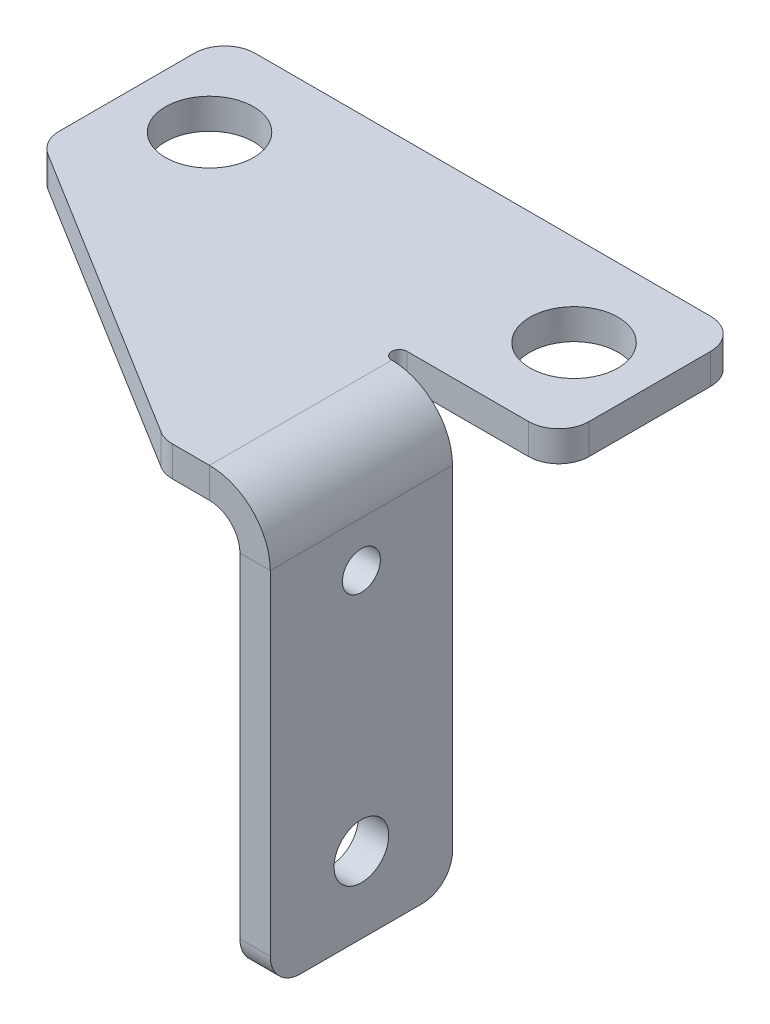
ISO-10303-21;
HEADER;
FILE_DESCRIPTION(('STEP AP214'),'2;1');
FILE_NAME('part.step','',(''),(''),'','','');
FILE_SCHEMA(('AUTOMOTIVE_DESIGN { 1 0 10303 214 1 1 1 1 }'));
ENDSEC;
DATA;
#1=APPLICATION_CONTEXT('core data for automotive mechanical design processes');
#2=APPLICATION_PROTOCOL_DEFINITION('international standard','automotive_design',2000,#1);
#3=PRODUCT_CONTEXT('',#1,'mechanical');
#4=PRODUCT('Part','Part','',(#3));
#5=PRODUCT_RELATED_PRODUCT_CATEGORY('part','',(#4));
#6=PRODUCT_DEFINITION_FORMATION('','',#4);
#7=PRODUCT_DEFINITION_CONTEXT('part definition',#1,'design');
#8=PRODUCT_DEFINITION('design','',#6,#7);
#9=PRODUCT_DEFINITION_SHAPE('','',#8);
#10=(LENGTH_UNIT() NAMED_UNIT(*) SI_UNIT(.MILLI.,.METRE.));
#11=(NAMED_UNIT(*) PLANE_ANGLE_UNIT() SI_UNIT($,.RADIAN.));
#12=(NAMED_UNIT(*) SI_UNIT($,.STERADIAN.) SOLID_ANGLE_UNIT());
#13=UNCERTAINTY_MEASURE_WITH_UNIT(LENGTH_MEASURE(1.E-05),#10,'distance_accuracy_value','');
#14=(GEOMETRIC_REPRESENTATION_CONTEXT(3) GLOBAL_UNCERTAINTY_ASSIGNED_CONTEXT((#13)) GLOBAL_UNIT_ASSIGNED_CONTEXT((#10,
#11,#12)) REPRESENTATION_CONTEXT('',''));
#15=CARTESIAN_POINT('',(0.,0.,0.));
#16=DIRECTION('',(0.,0.,1.));
#17=DIRECTION('',(1.,0.,0.));
#18=AXIS2_PLACEMENT_3D('',#15,#16,#17);
#19=CARTESIAN_POINT('',(-10.,2.,0.));
#20=DIRECTION('',(0.,0.,-1.));
#21=DIRECTION('',(-1.,0.,0.));
#22=AXIS2_PLACEMENT_3D('',#19,#20,#21);
#23=PLANE('',#22);
#24=DIRECTION('',(1.,0.,0.));
#25=VECTOR('',#24,1.);
#26=CARTESIAN_POINT('',(-10.,0.,0.));
#27=LINE('',#26,#25);
#28=CARTESIAN_POINT('',(-10.,0.,0.));
#29=VERTEX_POINT('',#28);
#30=CARTESIAN_POINT('',(-2.,0.,0.));
#31=VERTEX_POINT('',#30);
#32=EDGE_CURVE('E254',#29,#31,#27,.T.);
#33=ORIENTED_EDGE('',*,*,#32,.T.);
#34=DIRECTION('',(0.,-1.,0.));
#35=VECTOR('',#34,1.);
#36=CARTESIAN_POINT('',(-2.,2.,0.));
#37=LINE('',#36,#35);
#38=CARTESIAN_POINT('',(-2.,2.,0.));
#39=VERTEX_POINT('',#38);
#40=EDGE_CURVE('E13',#31,#39,#37,.F.);
#41=ORIENTED_EDGE('',*,*,#40,.T.);
#42=DIRECTION('',(1.,0.,0.));
#43=VECTOR('',#42,1.);
#44=CARTESIAN_POINT('',(-10.,2.,0.));
#45=LINE('',#44,#43);
#46=CARTESIAN_POINT('',(-10.,2.,0.));
#47=VERTEX_POINT('',#46);
#48=EDGE_CURVE('E259',#47,#39,#45,.T.);
#49=ORIENTED_EDGE('',*,*,#48,.F.);
#50=DIRECTION('',(0.,-1.,0.));
#51=VECTOR('',#50,1.);
#52=CARTESIAN_POINT('',(-10.,2.,0.));
#53=LINE('',#52,#51);
#54=EDGE_CURVE('E278',#47,#29,#53,.T.);
#55=ORIENTED_EDGE('',*,*,#54,.T.);
#56=EDGE_LOOP('',(#33,#41,#49,#55));
#57=FACE_BOUND('',#56,.T.);
#58=ADVANCED_FACE('F66',(#57),#23,.F.);
#59=CARTESIAN_POINT('',(0.,2.,0.));
#60=DIRECTION('',(-1.,0.,0.));
#61=DIRECTION('',(0.,0.,1.));
#62=AXIS2_PLACEMENT_3D('',#59,#60,#61);
#63=PLANE('',#62);
#64=DIRECTION('',(0.,0.,-1.));
#65=VECTOR('',#64,1.);
#66=CARTESIAN_POINT('',(0.,0.,0.));
#67=LINE('',#66,#65);
#68=CARTESIAN_POINT('',(0.,0.,-2.));
#69=VERTEX_POINT('',#68);
#70=CARTESIAN_POINT('',(0.,0.,-10.));
#71=VERTEX_POINT('',#70);
#72=EDGE_CURVE('E281',#69,#71,#67,.T.);
#73=ORIENTED_EDGE('',*,*,#72,.T.);
#74=DIRECTION('',(0.,-1.,0.));
#75=VECTOR('',#74,1.);
#76=CARTESIAN_POINT('',(0.,2.,-10.));
#77=LINE('',#76,#75);
#78=CARTESIAN_POINT('',(0.,2.,-10.));
#79=VERTEX_POINT('',#78);
#80=EDGE_CURVE('E74',#71,#79,#77,.F.);
#81=ORIENTED_EDGE('',*,*,#80,.T.);
#82=DIRECTION('',(0.,0.,-1.));
#83=VECTOR('',#82,1.);
#84=CARTESIAN_POINT('',(0.,2.,0.));
#85=LINE('',#84,#83);
#86=CARTESIAN_POINT('',(0.,2.,-2.));
#87=VERTEX_POINT('',#86);
#88=EDGE_CURVE('E262',#87,#79,#85,.T.);
#89=ORIENTED_EDGE('',*,*,#88,.F.);
#90=DIRECTION('',(0.,-1.,0.));
#91=VECTOR('',#90,1.);
#92=CARTESIAN_POINT('',(0.,2.,-2.));
#93=LINE('',#92,#91);
#94=EDGE_CURVE('E365',#87,#69,#93,.T.);
#95=ORIENTED_EDGE('',*,*,#94,.T.);
#96=EDGE_LOOP('',(#73,#81,#89,#95));
#97=FACE_BOUND('',#96,.T.);
#98=ADVANCED_FACE('F370',(#97),#63,.F.);
#99=CARTESIAN_POINT('',(0.,2.,-12.));
#100=DIRECTION('',(0.,0.,1.));
#101=DIRECTION('',(1.,0.,0.));
#102=AXIS2_PLACEMENT_3D('',#99,#100,#101);
#103=PLANE('',#102);
#104=DIRECTION('',(-1.,0.,0.));
#105=VECTOR('',#104,1.);
#106=CARTESIAN_POINT('',(0.,0.,-12.));
#107=LINE('',#106,#105);
#108=CARTESIAN_POINT('',(-2.,0.,-12.));
#109=VERTEX_POINT('',#108);
#110=CARTESIAN_POINT('',(-32.,0.,-12.));
#111=VERTEX_POINT('',#110);
#112=EDGE_CURVE('E284',#109,#111,#107,.T.);
#113=ORIENTED_EDGE('',*,*,#112,.T.);
#114=DIRECTION('',(0.,-1.,0.));
#115=VECTOR('',#114,1.);
#116=CARTESIAN_POINT('',(-32.,2.,-12.));
#117=LINE('',#116,#115);
#118=CARTESIAN_POINT('',(-32.,2.,-12.));
#119=VERTEX_POINT('',#118);
#120=EDGE_CURVE('E363',#111,#119,#117,.F.);
#121=ORIENTED_EDGE('',*,*,#120,.T.);
#122=DIRECTION('',(-1.,0.,0.));
#123=VECTOR('',#122,1.);
#124=CARTESIAN_POINT('',(0.,2.,-12.));
#125=LINE('',#124,#123);
#126=CARTESIAN_POINT('',(-2.,2.,-12.));
#127=VERTEX_POINT('',#126);
#128=EDGE_CURVE('E266',#127,#119,#125,.T.);
#129=ORIENTED_EDGE('',*,*,#128,.F.);
#130=DIRECTION('',(0.,-1.,0.));
#131=VECTOR('',#130,1.);
#132=CARTESIAN_POINT('',(-2.,2.,-12.));
#133=LINE('',#132,#131);
#134=EDGE_CURVE('E360',#127,#109,#133,.T.);
#135=ORIENTED_EDGE('',*,*,#134,.T.);
#136=EDGE_LOOP('',(#113,#121,#129,#135));
#137=FACE_BOUND('',#136,.T.);
#138=ADVANCED_FACE('F382',(#137),#103,.F.);
#139=CARTESIAN_POINT('',(-34.,2.,-12.));
#140=DIRECTION('',(1.,0.,0.));
#141=DIRECTION('',(0.,0.,-1.));
#142=AXIS2_PLACEMENT_3D('',#139,#140,#141);
#143=PLANE('',#142);
#144=DIRECTION('',(0.,0.,1.));
#145=VECTOR('',#144,1.);
#146=CARTESIAN_POINT('',(-34.,0.,-12.));
#147=LINE('',#146,#145);
#148=CARTESIAN_POINT('',(-34.,0.,-10.));
#149=VERTEX_POINT('',#148);
#150=CARTESIAN_POINT('',(-34.,0.,-1.11411219718637));
#151=VERTEX_POINT('',#150);
#152=EDGE_CURVE('E287',#149,#151,#147,.T.);
#153=ORIENTED_EDGE('',*,*,#152,.T.);
#154=DIRECTION('',(0.,-1.,0.));
#155=VECTOR('',#154,1.);
#156=CARTESIAN_POINT('',(-34.,2.,-1.11411219718637));
#157=LINE('',#156,#155);
#158=CARTESIAN_POINT('',(-34.,2.,-1.11411219718637));
#159=VERTEX_POINT('',#158);
#160=EDGE_CURVE('E81',#151,#159,#157,.F.);
#161=ORIENTED_EDGE('',*,*,#160,.T.);
#162=DIRECTION('',(0.,0.,1.));
#163=VECTOR('',#162,1.);
#164=CARTESIAN_POINT('',(-34.,2.,-12.));
#165=LINE('',#164,#163);
#166=CARTESIAN_POINT('',(-34.,2.,-10.));
#167=VERTEX_POINT('',#166);
#168=EDGE_CURVE('E268',#167,#159,#165,.T.);
#169=ORIENTED_EDGE('',*,*,#168,.F.);
#170=DIRECTION('',(0.,-1.,0.));
#171=VECTOR('',#170,1.);
#172=CARTESIAN_POINT('',(-34.,2.,-10.));
#173=LINE('',#172,#171);
#174=EDGE_CURVE('E356',#167,#149,#173,.T.);
#175=ORIENTED_EDGE('',*,*,#174,.T.);
#176=EDGE_LOOP('',(#153,#161,#169,#175));
#177=FACE_BOUND('',#176,.T.);
#178=ADVANCED_FACE('F391',(#177),#143,.F.);
#179=CARTESIAN_POINT('',(-34.,2.,0.));
#180=DIRECTION('',(0.526354614616296,0.,-0.850265146687862));
#181=DIRECTION('',(-0.850265146687862,0.,-0.526354614616296));
#182=AXIS2_PLACEMENT_3D('',#179,#180,#181);
#183=PLANE('',#182);
#184=DIRECTION('',(0.850265146687862,0.,0.526354614616296));
#185=VECTOR('',#184,1.);
#186=CARTESIAN_POINT('',(-34.,0.,0.));
#187=LINE('',#186,#185);
#188=CARTESIAN_POINT('',(-33.0527092292326,0.,0.58641809618935));
#189=VERTEX_POINT('',#188);
#190=CARTESIAN_POINT('',(-13.4837587568546,0.,12.7005302933757));
#191=VERTEX_POINT('',#190);
#192=EDGE_CURVE('E289',#189,#191,#187,.T.);
#193=ORIENTED_EDGE('',*,*,#192,.T.);
#194=DIRECTION('',(0.,-1.,0.));
#195=VECTOR('',#194,1.);
#196=CARTESIAN_POINT('',(-13.4837587568546,2.,12.7005302933757));
#197=LINE('',#196,#195);
#198=CARTESIAN_POINT('',(-13.4837587568546,2.,12.7005302933757));
#199=VERTEX_POINT('',#198);
#200=EDGE_CURVE('E345',#191,#199,#197,.F.);
#201=ORIENTED_EDGE('',*,*,#200,.T.);
#202=DIRECTION('',(0.850265146687862,0.,0.526354614616296));
#203=VECTOR('',#202,1.);
#204=CARTESIAN_POINT('',(-34.,2.,0.));
#205=LINE('',#204,#203);
#206=CARTESIAN_POINT('',(-33.0527092292326,2.,0.58641809618935));
#207=VERTEX_POINT('',#206);
#208=EDGE_CURVE('E270',#207,#199,#205,.T.);
#209=ORIENTED_EDGE('',*,*,#208,.F.);
#210=DIRECTION('',(0.,-1.,0.));
#211=VECTOR('',#210,1.);
#212=CARTESIAN_POINT('',(-33.0527092292326,2.,0.58641809618935));
#213=LINE('',#212,#211);
#214=EDGE_CURVE('E342',#207,#189,#213,.T.);
#215=ORIENTED_EDGE('',*,*,#214,.T.);
#216=EDGE_LOOP('',(#193,#201,#209,#215));
#217=FACE_BOUND('',#216,.T.);
#218=ADVANCED_FACE('F399',(#217),#183,.F.);
#219=CARTESIAN_POINT('',(-10.,2.,13.));
#220=DIRECTION('',(0.,0.,-1.));
#221=DIRECTION('',(-1.,0.,0.));
#222=AXIS2_PLACEMENT_3D('',#219,#220,#221);
#223=PLANE('',#222);
#224=DIRECTION('',(1.,0.,0.));
#225=VECTOR('',#224,1.);
#226=CARTESIAN_POINT('',(-10.,2.,13.));
#227=LINE('',#226,#225);
#228=CARTESIAN_POINT('',(-12.431049527622,2.,13.));
#229=VERTEX_POINT('',#228);
#230=CARTESIAN_POINT('',(-10.,2.,13.));
#231=VERTEX_POINT('',#230);
#232=EDGE_CURVE('E273',#229,#231,#227,.T.);
#233=ORIENTED_EDGE('',*,*,#232,.F.);
#234=DIRECTION('',(0.,-1.,0.));
#235=VECTOR('',#234,1.);
#236=CARTESIAN_POINT('',(-12.431049527622,2.,13.));
#237=LINE('',#236,#235);
#238=CARTESIAN_POINT('',(-12.431049527622,0.,13.));
#239=VERTEX_POINT('',#238);
#240=EDGE_CURVE('E329',#229,#239,#237,.T.);
#241=ORIENTED_EDGE('',*,*,#240,.T.);
#242=DIRECTION('',(1.,0.,0.));
#243=VECTOR('',#242,1.);
#244=CARTESIAN_POINT('',(-10.,0.,13.));
#245=LINE('',#244,#243);
#246=CARTESIAN_POINT('',(-10.,0.,13.));
#247=VERTEX_POINT('',#246);
#248=EDGE_CURVE('E292',#239,#247,#245,.T.);
#249=ORIENTED_EDGE('',*,*,#248,.T.);
#250=DIRECTION('',(0.,-1.,0.));
#251=VECTOR('',#250,1.);
#252=CARTESIAN_POINT('',(-10.,2.,13.));
#253=LINE('',#252,#251);
#254=EDGE_CURVE('E302',#231,#247,#253,.T.);
#255=ORIENTED_EDGE('',*,*,#254,.F.);
#256=EDGE_LOOP('',(#233,#241,#249,#255));
#257=FACE_BOUND('',#256,.T.);
#258=ADVANCED_FACE('F408',(#257),#223,.F.);
#259=CARTESIAN_POINT('',(-10.,2.,0.5));
#260=DIRECTION('',(0.,-1.,0.));
#261=DIRECTION('',(0.,0.,-1.));
#262=AXIS2_PLACEMENT_3D('',#259,#260,#261);
#263=CYLINDRICAL_SURFACE('',#262,0.5);
#264=CARTESIAN_POINT('',(-10.,0.,0.5));
#265=DIRECTION('',(0.,-1.,0.));
#266=DIRECTION('',(0.,0.,-1.));
#267=AXIS2_PLACEMENT_3D('',#264,#265,#266);
#268=CIRCLE('',#267,0.5);
#269=CARTESIAN_POINT('',(-10.,0.,1.));
#270=VERTEX_POINT('',#269);
#271=EDGE_CURVE('E263',#270,#29,#268,.T.);
#272=ORIENTED_EDGE('',*,*,#271,.T.);
#273=ORIENTED_EDGE('',*,*,#54,.F.);
#274=CARTESIAN_POINT('',(-10.,2.,0.5));
#275=DIRECTION('',(0.,-1.,0.));
#276=DIRECTION('',(0.,0.,-1.));
#277=AXIS2_PLACEMENT_3D('',#274,#275,#276);
#278=CIRCLE('',#277,0.5);
#279=CARTESIAN_POINT('',(-10.,2.,1.));
#280=VERTEX_POINT('',#279);
#281=EDGE_CURVE('E276',#280,#47,#278,.T.);
#282=ORIENTED_EDGE('',*,*,#281,.F.);
#283=DIRECTION('',(0.,-1.,0.));
#284=VECTOR('',#283,1.);
#285=CARTESIAN_POINT('',(-10.,2.,1.));
#286=LINE('',#285,#284);
#287=EDGE_CURVE('E299',#280,#270,#286,.T.);
#288=ORIENTED_EDGE('',*,*,#287,.T.);
#289=EDGE_LOOP('',(#272,#273,#282,#288));
#290=FACE_BOUND('',#289,.T.);
#291=ADVANCED_FACE('F412',(#290),#263,.F.);
#292=CARTESIAN_POINT('',(-10.,2.,0.5));
#293=DIRECTION('',(0.,-1.,0.));
#294=DIRECTION('',(0.,0.,-1.));
#295=AXIS2_PLACEMENT_3D('',#292,#293,#294);
#296=PLANE('',#295);
#297=CARTESIAN_POINT('',(-29.,2.,-6.));
#298=DIRECTION('',(0.,1.,0.));
#299=DIRECTION('',(0.,0.,1.));
#300=AXIS2_PLACEMENT_3D('',#297,#298,#299);
#301=CIRCLE('',#300,2.9);
#302=CARTESIAN_POINT('',(-29.,2.,-3.1));
#303=VERTEX_POINT('',#302);
#304=EDGE_CURVE('E519',#303,#303,#301,.T.);
#305=ORIENTED_EDGE('',*,*,#304,.F.);
#306=EDGE_LOOP('',(#305));
#307=FACE_BOUND('',#306,.T.);
#308=CARTESIAN_POINT('',(-5.,2.,-6.));
#309=DIRECTION('',(0.,1.,0.));
#310=DIRECTION('',(0.,0.,1.));
#311=AXIS2_PLACEMENT_3D('',#308,#309,#310);
#312=CIRCLE('',#311,2.9);
#313=CARTESIAN_POINT('',(-5.,2.,-3.1));
#314=VERTEX_POINT('',#313);
#315=EDGE_CURVE('E307',#314,#314,#312,.T.);
#316=ORIENTED_EDGE('',*,*,#315,.F.);
#317=EDGE_LOOP('',(#316));
#318=FACE_BOUND('',#317,.T.);
#319=ORIENTED_EDGE('',*,*,#208,.T.);
#320=CARTESIAN_POINT('',(-12.431049527622,2.,11.));
#321=DIRECTION('',(0.,-1.,0.));
#322=DIRECTION('',(0.,0.,-1.));
#323=AXIS2_PLACEMENT_3D('',#320,#321,#322);
#324=CIRCLE('',#323,2.);
#325=EDGE_CURVE('E354',#199,#229,#324,.F.);
#326=ORIENTED_EDGE('',*,*,#325,.T.);
#327=ORIENTED_EDGE('',*,*,#232,.T.);
#328=DIRECTION('',(0.,0.,-1.));
#329=VECTOR('',#328,1.);
#330=CARTESIAN_POINT('',(-10.,2.,13.));
#331=LINE('',#330,#329);
#332=EDGE_CURVE('E206',#231,#280,#331,.T.);
#333=ORIENTED_EDGE('',*,*,#332,.T.);
#334=ORIENTED_EDGE('',*,*,#281,.T.);
#335=ORIENTED_EDGE('',*,*,#48,.T.);
#336=CARTESIAN_POINT('',(-2.,2.,-2.));
#337=DIRECTION('',(0.,-1.,0.));
#338=DIRECTION('',(0.,0.,-1.));
#339=AXIS2_PLACEMENT_3D('',#336,#337,#338);
#340=CIRCLE('',#339,2.);
#341=EDGE_CURVE('E347',#39,#87,#340,.F.);
#342=ORIENTED_EDGE('',*,*,#341,.T.);
#343=ORIENTED_EDGE('',*,*,#88,.T.);
#344=CARTESIAN_POINT('',(-2.,2.,-10.));
#345=DIRECTION('',(0.,-1.,0.));
#346=DIRECTION('',(0.,0.,-1.));
#347=AXIS2_PLACEMENT_3D('',#344,#345,#346);
#348=CIRCLE('',#347,2.);
#349=EDGE_CURVE('E349',#79,#127,#348,.F.);
#350=ORIENTED_EDGE('',*,*,#349,.T.);
#351=ORIENTED_EDGE('',*,*,#128,.T.);
#352=CARTESIAN_POINT('',(-32.,2.,-10.));
#353=DIRECTION('',(0.,-1.,0.));
#354=DIRECTION('',(0.,0.,-1.));
#355=AXIS2_PLACEMENT_3D('',#352,#353,#354);
#356=CIRCLE('',#355,2.);
#357=EDGE_CURVE('E88',#119,#167,#356,.F.);
#358=ORIENTED_EDGE('',*,*,#357,.T.);
#359=ORIENTED_EDGE('',*,*,#168,.T.);
#360=CARTESIAN_POINT('',(-32.,2.,-1.11411219718637));
#361=DIRECTION('',(0.,-1.,0.));
#362=DIRECTION('',(0.,0.,-1.));
#363=AXIS2_PLACEMENT_3D('',#360,#361,#362);
#364=CIRCLE('',#363,2.);
#365=EDGE_CURVE('E352',#159,#207,#364,.F.);
#366=ORIENTED_EDGE('',*,*,#365,.T.);
#367=EDGE_LOOP('',(#319,#326,#327,#333,#334,#335,#342,#343,#350,#351,#358,#359,#366));
#368=FACE_BOUND('',#367,.T.);
#369=ADVANCED_FACE('F375',(#307,#318,#368),#296,.F.);
#370=CARTESIAN_POINT('',(-10.,0.,0.5));
#371=DIRECTION('',(0.,-1.,0.));
#372=DIRECTION('',(0.,0.,-1.));
#373=AXIS2_PLACEMENT_3D('',#370,#371,#372);
#374=PLANE('',#373);
#375=CARTESIAN_POINT('',(-29.,0.,-6.));
#376=DIRECTION('',(0.,-1.,0.));
#377=DIRECTION('',(0.,0.,-1.));
#378=AXIS2_PLACEMENT_3D('',#375,#376,#377);
#379=CIRCLE('',#378,2.9);
#380=CARTESIAN_POINT('',(-29.,0.,-8.9));
#381=VERTEX_POINT('',#380);
#382=EDGE_CURVE('E525',#381,#381,#379,.T.);
#383=ORIENTED_EDGE('',*,*,#382,.F.);
#384=EDGE_LOOP('',(#383));
#385=FACE_BOUND('',#384,.T.);
#386=CARTESIAN_POINT('',(-5.,0.,-6.));
#387=DIRECTION('',(0.,-1.,0.));
#388=DIRECTION('',(0.,0.,-1.));
#389=AXIS2_PLACEMENT_3D('',#386,#387,#388);
#390=CIRCLE('',#389,2.9);
#391=CARTESIAN_POINT('',(-5.,0.,-8.9));
#392=VERTEX_POINT('',#391);
#393=EDGE_CURVE('E253',#392,#392,#390,.T.);
#394=ORIENTED_EDGE('',*,*,#393,.F.);
#395=EDGE_LOOP('',(#394));
#396=FACE_BOUND('',#395,.T.);
#397=ORIENTED_EDGE('',*,*,#248,.F.);
#398=CARTESIAN_POINT('',(-12.431049527622,0.,11.));
#399=DIRECTION('',(0.,-1.,0.));
#400=DIRECTION('',(0.,0.,-1.));
#401=AXIS2_PLACEMENT_3D('',#398,#399,#400);
#402=CIRCLE('',#401,2.);
#403=EDGE_CURVE('E340',#239,#191,#402,.T.);
#404=ORIENTED_EDGE('',*,*,#403,.T.);
#405=ORIENTED_EDGE('',*,*,#192,.F.);
#406=CARTESIAN_POINT('',(-32.,0.,-1.11411219718637));
#407=DIRECTION('',(0.,-1.,0.));
#408=DIRECTION('',(0.,0.,-1.));
#409=AXIS2_PLACEMENT_3D('',#406,#407,#408);
#410=CIRCLE('',#409,2.);
#411=EDGE_CURVE('E338',#189,#151,#410,.T.);
#412=ORIENTED_EDGE('',*,*,#411,.T.);
#413=ORIENTED_EDGE('',*,*,#152,.F.);
#414=CARTESIAN_POINT('',(-32.,0.,-10.));
#415=DIRECTION('',(0.,-1.,0.));
#416=DIRECTION('',(0.,0.,-1.));
#417=AXIS2_PLACEMENT_3D('',#414,#415,#416);
#418=CIRCLE('',#417,2.);
#419=EDGE_CURVE('E336',#149,#111,#418,.T.);
#420=ORIENTED_EDGE('',*,*,#419,.T.);
#421=ORIENTED_EDGE('',*,*,#112,.F.);
#422=CARTESIAN_POINT('',(-2.,0.,-10.));
#423=DIRECTION('',(0.,-1.,0.));
#424=DIRECTION('',(0.,0.,-1.));
#425=AXIS2_PLACEMENT_3D('',#422,#423,#424);
#426=CIRCLE('',#425,2.);
#427=EDGE_CURVE('E334',#109,#71,#426,.T.);
#428=ORIENTED_EDGE('',*,*,#427,.T.);
#429=ORIENTED_EDGE('',*,*,#72,.F.);
#430=CARTESIAN_POINT('',(-2.,0.,-2.));
#431=DIRECTION('',(0.,-1.,0.));
#432=DIRECTION('',(0.,0.,-1.));
#433=AXIS2_PLACEMENT_3D('',#430,#431,#432);
#434=CIRCLE('',#433,2.);
#435=EDGE_CURVE('E332',#69,#31,#434,.T.);
#436=ORIENTED_EDGE('',*,*,#435,.T.);
#437=ORIENTED_EDGE('',*,*,#32,.F.);
#438=ORIENTED_EDGE('',*,*,#271,.F.);
#439=DIRECTION('',(0.,0.,-1.));
#440=VECTOR('',#439,1.);
#441=CARTESIAN_POINT('',(-10.,0.,13.));
#442=LINE('',#441,#440);
#443=EDGE_CURVE('E294',#247,#270,#442,.T.);
#444=ORIENTED_EDGE('',*,*,#443,.F.);
#445=EDGE_LOOP('',(#397,#404,#405,#412,#413,#420,#421,#428,#429,#436,#437,#438,#444));
#446=FACE_BOUND('',#445,.T.);
#447=ADVANCED_FACE('F386',(#385,#396,#446),#374,.T.);
#448=CARTESIAN_POINT('',(-10.,-2.,1.));
#449=DIRECTION('',(0.,0.,-1.));
#450=DIRECTION('',(-1.,0.,0.));
#451=AXIS2_PLACEMENT_3D('',#448,#449,#450);
#452=PLANE('',#451);
#453=DIRECTION('',(-1.,0.,0.));
#454=VECTOR('',#453,1.);
#455=CARTESIAN_POINT('',(-6.,-1.99999999999999,1.));
#456=LINE('',#455,#454);
#457=CARTESIAN_POINT('',(-8.,-1.99999999999999,1.));
#458=VERTEX_POINT('',#457);
#459=CARTESIAN_POINT('',(-6.,-1.99999999999999,1.));
#460=VERTEX_POINT('',#459);
#461=EDGE_CURVE('E250',#458,#460,#456,.F.);
#462=ORIENTED_EDGE('',*,*,#461,.F.);
#463=CARTESIAN_POINT('',(-10.,-2.,1.));
#464=DIRECTION('',(0.,0.,1.));
#465=DIRECTION('',(1.,0.,0.));
#466=AXIS2_PLACEMENT_3D('',#463,#464,#465);
#467=CIRCLE('',#466,2.);
#468=EDGE_CURVE('E211',#270,#458,#467,.F.);
#469=ORIENTED_EDGE('',*,*,#468,.F.);
#470=ORIENTED_EDGE('',*,*,#287,.F.);
#471=CARTESIAN_POINT('',(-10.,-2.,1.));
#472=DIRECTION('',(0.,0.,1.));
#473=DIRECTION('',(1.,0.,0.));
#474=AXIS2_PLACEMENT_3D('',#471,#472,#473);
#475=CIRCLE('',#474,4.);
#476=EDGE_CURVE('E210',#280,#460,#475,.F.);
#477=ORIENTED_EDGE('',*,*,#476,.T.);
#478=EDGE_LOOP('',(#462,#469,#470,#477));
#479=FACE_BOUND('',#478,.T.);
#480=ADVANCED_FACE('F426',(#479),#452,.T.);
#481=CARTESIAN_POINT('',(-10.,-2.,13.));
#482=DIRECTION('',(0.,0.,-1.));
#483=DIRECTION('',(-1.,0.,0.));
#484=AXIS2_PLACEMENT_3D('',#481,#482,#483);
#485=PLANE('',#484);
#486=CARTESIAN_POINT('',(-10.,-2.,13.));
#487=DIRECTION('',(0.,0.,1.));
#488=DIRECTION('',(1.,0.,0.));
#489=AXIS2_PLACEMENT_3D('',#486,#487,#488);
#490=CIRCLE('',#489,2.);
#491=CARTESIAN_POINT('',(-8.,-1.99999999999999,13.));
#492=VERTEX_POINT('',#491);
#493=EDGE_CURVE('E218',#492,#247,#490,.T.);
#494=ORIENTED_EDGE('',*,*,#493,.F.);
#495=DIRECTION('',(-1.,0.,0.));
#496=VECTOR('',#495,1.);
#497=CARTESIAN_POINT('',(-8.,-1.99999999999999,13.));
#498=LINE('',#497,#496);
#499=CARTESIAN_POINT('',(-6.,-1.99999999999999,13.));
#500=VERTEX_POINT('',#499);
#501=EDGE_CURVE('E215',#492,#500,#498,.F.);
#502=ORIENTED_EDGE('',*,*,#501,.T.);
#503=CARTESIAN_POINT('',(-10.,-2.,13.));
#504=DIRECTION('',(0.,0.,1.));
#505=DIRECTION('',(1.,0.,0.));
#506=AXIS2_PLACEMENT_3D('',#503,#504,#505);
#507=CIRCLE('',#506,4.);
#508=EDGE_CURVE('E199',#500,#231,#507,.T.);
#509=ORIENTED_EDGE('',*,*,#508,.T.);
#510=ORIENTED_EDGE('',*,*,#254,.T.);
#511=EDGE_LOOP('',(#494,#502,#509,#510));
#512=FACE_BOUND('',#511,.T.);
#513=ADVANCED_FACE('F216',(#512),#485,.F.);
#514=CARTESIAN_POINT('',(-10.,-2.,13.));
#515=DIRECTION('',(0.,0.,1.));
#516=DIRECTION('',(1.,0.,0.));
#517=AXIS2_PLACEMENT_3D('',#514,#515,#516);
#518=CYLINDRICAL_SURFACE('',#517,4.);
#519=ORIENTED_EDGE('',*,*,#332,.F.);
#520=ORIENTED_EDGE('',*,*,#508,.F.);
#521=DIRECTION('',(0.,0.,1.));
#522=VECTOR('',#521,1.);
#523=CARTESIAN_POINT('',(-6.,-1.99999999999999,1.));
#524=LINE('',#523,#522);
#525=EDGE_CURVE('E203',#500,#460,#524,.F.);
#526=ORIENTED_EDGE('',*,*,#525,.T.);
#527=ORIENTED_EDGE('',*,*,#476,.F.);
#528=EDGE_LOOP('',(#519,#520,#526,#527));
#529=FACE_BOUND('',#528,.T.);
#530=ADVANCED_FACE('F201',(#529),#518,.T.);
#531=CARTESIAN_POINT('',(-10.,-2.,13.));
#532=DIRECTION('',(0.,0.,1.));
#533=DIRECTION('',(1.,0.,0.));
#534=AXIS2_PLACEMENT_3D('',#531,#532,#533);
#535=CYLINDRICAL_SURFACE('',#534,2.);
#536=ORIENTED_EDGE('',*,*,#443,.T.);
#537=ORIENTED_EDGE('',*,*,#468,.T.);
#538=DIRECTION('',(0.,0.,1.));
#539=VECTOR('',#538,1.);
#540=CARTESIAN_POINT('',(-8.,-1.99999999999999,1.));
#541=LINE('',#540,#539);
#542=EDGE_CURVE('E223',#458,#492,#541,.T.);
#543=ORIENTED_EDGE('',*,*,#542,.T.);
#544=ORIENTED_EDGE('',*,*,#493,.T.);
#545=EDGE_LOOP('',(#536,#537,#543,#544));
#546=FACE_BOUND('',#545,.T.);
#547=ADVANCED_FACE('F422',(#546),#535,.F.);
#548=CARTESIAN_POINT('',(-5.99999999999991,-26.,13.));
#549=DIRECTION('',(0.,0.,-1.));
#550=DIRECTION('',(-1.,0.,0.));
#551=AXIS2_PLACEMENT_3D('',#548,#549,#550);
#552=PLANE('',#551);
#553=DIRECTION('',(0.,1.,0.));
#554=VECTOR('',#553,1.);
#555=CARTESIAN_POINT('',(-7.99999999999991,-26.,13.));
#556=LINE('',#555,#554);
#557=CARTESIAN_POINT('',(-7.99999999999992,-24.,13.));
#558=VERTEX_POINT('',#557);
#559=EDGE_CURVE('E233',#492,#558,#556,.F.);
#560=ORIENTED_EDGE('',*,*,#559,.T.);
#561=DIRECTION('',(-1.,0.,0.));
#562=VECTOR('',#561,1.);
#563=CARTESIAN_POINT('',(-5.99999999999992,-24.,13.));
#564=LINE('',#563,#562);
#565=CARTESIAN_POINT('',(-5.99999999999992,-24.,13.));
#566=VERTEX_POINT('',#565);
#567=EDGE_CURVE('E237',#558,#566,#564,.F.);
#568=ORIENTED_EDGE('',*,*,#567,.T.);
#569=DIRECTION('',(0.,-1.,0.));
#570=VECTOR('',#569,1.);
#571=CARTESIAN_POINT('',(-6.00000000000001,0.,13.));
#572=LINE('',#571,#570);
#573=EDGE_CURVE('E229',#500,#566,#572,.T.);
#574=ORIENTED_EDGE('',*,*,#573,.F.);
#575=ORIENTED_EDGE('',*,*,#501,.F.);
#576=EDGE_LOOP('',(#560,#568,#574,#575));
#577=FACE_BOUND('',#576,.T.);
#578=ADVANCED_FACE('F235',(#577),#552,.F.);
#579=CARTESIAN_POINT('',(-6.00000000000001,0.,1.));
#580=DIRECTION('',(0.,0.,1.));
#581=DIRECTION('',(1.,0.,0.));
#582=AXIS2_PLACEMENT_3D('',#579,#580,#581);
#583=PLANE('',#582);
#584=DIRECTION('',(0.,1.,0.));
#585=VECTOR('',#584,1.);
#586=CARTESIAN_POINT('',(-6.00000000000001,0.,1.));
#587=LINE('',#586,#585);
#588=CARTESIAN_POINT('',(-5.99999999999992,-24.,1.));
#589=VERTEX_POINT('',#588);
#590=EDGE_CURVE('E232',#589,#460,#587,.T.);
#591=ORIENTED_EDGE('',*,*,#590,.F.);
#592=DIRECTION('',(-1.,0.,0.));
#593=VECTOR('',#592,1.);
#594=CARTESIAN_POINT('',(-5.99999999999992,-24.,1.));
#595=LINE('',#594,#593);
#596=CARTESIAN_POINT('',(-7.99999999999992,-24.,1.));
#597=VERTEX_POINT('',#596);
#598=EDGE_CURVE('E304',#589,#597,#595,.T.);
#599=ORIENTED_EDGE('',*,*,#598,.T.);
#600=DIRECTION('',(0.,-1.,0.));
#601=VECTOR('',#600,1.);
#602=CARTESIAN_POINT('',(-8.00000000000001,0.,1.));
#603=LINE('',#602,#601);
#604=EDGE_CURVE('E239',#597,#458,#603,.F.);
#605=ORIENTED_EDGE('',*,*,#604,.T.);
#606=ORIENTED_EDGE('',*,*,#461,.T.);
#607=EDGE_LOOP('',(#591,#599,#605,#606));
#608=FACE_BOUND('',#607,.T.);
#609=ADVANCED_FACE('F428',(#608),#583,.F.);
#610=CARTESIAN_POINT('',(-6.00000000000001,0.,0.));
#611=DIRECTION('',(-1.,0.,0.));
#612=DIRECTION('',(0.,-1.,0.));
#613=AXIS2_PLACEMENT_3D('',#610,#611,#612);
#614=PLANE('',#613);
#615=CARTESIAN_POINT('',(-5.99999999999999,-5.,7.));
#616=DIRECTION('',(1.,0.,0.));
#617=DIRECTION('',(0.,1.,0.));
#618=AXIS2_PLACEMENT_3D('',#615,#616,#617);
#619=CIRCLE('',#618,1.25);
#620=CARTESIAN_POINT('',(-5.99999999999999,-3.75,7.));
#621=VERTEX_POINT('',#620);
#622=EDGE_CURVE('E312',#621,#621,#619,.T.);
#623=ORIENTED_EDGE('',*,*,#622,.F.);
#624=EDGE_LOOP('',(#623));
#625=FACE_BOUND('',#624,.T.);
#626=CARTESIAN_POINT('',(-5.99999999999993,-21.,7.));
#627=DIRECTION('',(1.,0.,0.));
#628=DIRECTION('',(0.,0.,-1.));
#629=AXIS2_PLACEMENT_3D('',#626,#627,#628);
#630=CIRCLE('',#629,1.8);
#631=CARTESIAN_POINT('',(-5.99999999999993,-21.,5.2));
#632=VERTEX_POINT('',#631);
#633=EDGE_CURVE('E311',#632,#632,#630,.T.);
#634=ORIENTED_EDGE('',*,*,#633,.F.);
#635=EDGE_LOOP('',(#634));
#636=FACE_BOUND('',#635,.T.);
#637=DIRECTION('',(0.,0.,-1.));
#638=VECTOR('',#637,1.);
#639=CARTESIAN_POINT('',(-5.99999999999992,-26.,0.));
#640=LINE('',#639,#638);
#641=CARTESIAN_POINT('',(-5.99999999999991,-26.,11.));
#642=VERTEX_POINT('',#641);
#643=CARTESIAN_POINT('',(-5.99999999999992,-26.,3.));
#644=VERTEX_POINT('',#643);
#645=EDGE_CURVE('E238',#642,#644,#640,.T.);
#646=ORIENTED_EDGE('',*,*,#645,.T.);
#647=CARTESIAN_POINT('',(-5.99999999999992,-24.,3.));
#648=DIRECTION('',(-1.,0.,0.));
#649=DIRECTION('',(0.,-1.,0.));
#650=AXIS2_PLACEMENT_3D('',#647,#648,#649);
#651=CIRCLE('',#650,2.);
#652=EDGE_CURVE('E326',#644,#589,#651,.F.);
#653=ORIENTED_EDGE('',*,*,#652,.T.);
#654=ORIENTED_EDGE('',*,*,#590,.T.);
#655=ORIENTED_EDGE('',*,*,#525,.F.);
#656=ORIENTED_EDGE('',*,*,#573,.T.);
#657=CARTESIAN_POINT('',(-5.99999999999992,-24.,11.));
#658=DIRECTION('',(-1.,0.,0.));
#659=DIRECTION('',(0.,-1.,0.));
#660=AXIS2_PLACEMENT_3D('',#657,#658,#659);
#661=CIRCLE('',#660,2.);
#662=EDGE_CURVE('E324',#566,#642,#661,.F.);
#663=ORIENTED_EDGE('',*,*,#662,.T.);
#664=EDGE_LOOP('',(#646,#653,#654,#655,#656,#663));
#665=FACE_BOUND('',#664,.T.);
#666=ADVANCED_FACE('F228',(#625,#636,#665),#614,.F.);
#667=CARTESIAN_POINT('',(-8.00000000000001,0.,0.));
#668=DIRECTION('',(-1.,0.,0.));
#669=DIRECTION('',(0.,-1.,0.));
#670=AXIS2_PLACEMENT_3D('',#667,#668,#669);
#671=PLANE('',#670);
#672=CARTESIAN_POINT('',(-7.99999999999999,-5.00000000000001,7.));
#673=DIRECTION('',(-1.,0.,0.));
#674=DIRECTION('',(0.,-1.,0.));
#675=AXIS2_PLACEMENT_3D('',#672,#673,#674);
#676=CIRCLE('',#675,1.25);
#677=CARTESIAN_POINT('',(-7.99999999999999,-6.25000000000001,7.));
#678=VERTEX_POINT('',#677);
#679=EDGE_CURVE('E308',#678,#678,#676,.T.);
#680=ORIENTED_EDGE('',*,*,#679,.F.);
#681=EDGE_LOOP('',(#680));
#682=FACE_BOUND('',#681,.T.);
#683=CARTESIAN_POINT('',(-7.99999999999993,-21.,7.));
#684=DIRECTION('',(-1.,0.,0.));
#685=DIRECTION('',(0.,-1.,0.));
#686=AXIS2_PLACEMENT_3D('',#683,#684,#685);
#687=CIRCLE('',#686,1.8);
#688=CARTESIAN_POINT('',(-7.99999999999993,-22.8,7.));
#689=VERTEX_POINT('',#688);
#690=EDGE_CURVE('E514',#689,#689,#687,.T.);
#691=ORIENTED_EDGE('',*,*,#690,.F.);
#692=EDGE_LOOP('',(#691));
#693=FACE_BOUND('',#692,.T.);
#694=ORIENTED_EDGE('',*,*,#604,.F.);
#695=CARTESIAN_POINT('',(-7.99999999999992,-24.,3.));
#696=DIRECTION('',(-1.,0.,0.));
#697=DIRECTION('',(0.,-1.,0.));
#698=AXIS2_PLACEMENT_3D('',#695,#696,#697);
#699=CIRCLE('',#698,2.);
#700=CARTESIAN_POINT('',(-7.99999999999992,-26.,3.));
#701=VERTEX_POINT('',#700);
#702=EDGE_CURVE('E317',#597,#701,#699,.T.);
#703=ORIENTED_EDGE('',*,*,#702,.T.);
#704=DIRECTION('',(0.,0.,1.));
#705=VECTOR('',#704,1.);
#706=CARTESIAN_POINT('',(-7.99999999999992,-26.,1.));
#707=LINE('',#706,#705);
#708=CARTESIAN_POINT('',(-7.99999999999991,-26.,11.));
#709=VERTEX_POINT('',#708);
#710=EDGE_CURVE('E242',#709,#701,#707,.F.);
#711=ORIENTED_EDGE('',*,*,#710,.F.);
#712=CARTESIAN_POINT('',(-7.99999999999992,-24.,11.));
#713=DIRECTION('',(-1.,0.,0.));
#714=DIRECTION('',(0.,-1.,0.));
#715=AXIS2_PLACEMENT_3D('',#712,#713,#714);
#716=CIRCLE('',#715,2.);
#717=EDGE_CURVE('E315',#709,#558,#716,.T.);
#718=ORIENTED_EDGE('',*,*,#717,.T.);
#719=ORIENTED_EDGE('',*,*,#559,.F.);
#720=ORIENTED_EDGE('',*,*,#542,.F.);
#721=EDGE_LOOP('',(#694,#703,#711,#718,#719,#720));
#722=FACE_BOUND('',#721,.T.);
#723=ADVANCED_FACE('F432',(#682,#693,#722),#671,.T.);
#724=CARTESIAN_POINT('',(-5.99999999999992,-26.,1.));
#725=DIRECTION('',(0.,1.,0.));
#726=DIRECTION('',(-1.,0.,0.));
#727=AXIS2_PLACEMENT_3D('',#724,#725,#726);
#728=PLANE('',#727);
#729=ORIENTED_EDGE('',*,*,#710,.T.);
#730=DIRECTION('',(-1.,0.,0.));
#731=VECTOR('',#730,1.);
#732=CARTESIAN_POINT('',(-5.99999999999992,-26.,3.));
#733=LINE('',#732,#731);
#734=EDGE_CURVE('E322',#701,#644,#733,.F.);
#735=ORIENTED_EDGE('',*,*,#734,.T.);
#736=ORIENTED_EDGE('',*,*,#645,.F.);
#737=DIRECTION('',(-1.,0.,0.));
#738=VECTOR('',#737,1.);
#739=CARTESIAN_POINT('',(-5.99999999999991,-26.,11.));
#740=LINE('',#739,#738);
#741=EDGE_CURVE('E319',#642,#709,#740,.T.);
#742=ORIENTED_EDGE('',*,*,#741,.T.);
#743=EDGE_LOOP('',(#729,#735,#736,#742));
#744=FACE_BOUND('',#743,.T.);
#745=ADVANCED_FACE('F440',(#744),#728,.F.);
#746=CARTESIAN_POINT('',(-5.,2.,-6.));
#747=DIRECTION('',(0.,1.,0.));
#748=DIRECTION('',(0.,0.,1.));
#749=AXIS2_PLACEMENT_3D('',#746,#747,#748);
#750=CYLINDRICAL_SURFACE('',#749,2.9);
#751=ORIENTED_EDGE('',*,*,#393,.T.);
#752=EDGE_LOOP('',(#751));
#753=FACE_BOUND('',#752,.T.);
#754=ORIENTED_EDGE('',*,*,#315,.T.);
#755=EDGE_LOOP('',(#754));
#756=FACE_BOUND('',#755,.T.);
#757=ADVANCED_FACE('F491',(#753,#756),#750,.F.);
#758=CARTESIAN_POINT('',(-29.,2.,-6.));
#759=DIRECTION('',(0.,1.,0.));
#760=DIRECTION('',(0.,0.,1.));
#761=AXIS2_PLACEMENT_3D('',#758,#759,#760);
#762=CYLINDRICAL_SURFACE('',#761,2.9);
#763=ORIENTED_EDGE('',*,*,#382,.T.);
#764=EDGE_LOOP('',(#763));
#765=FACE_BOUND('',#764,.T.);
#766=ORIENTED_EDGE('',*,*,#304,.T.);
#767=EDGE_LOOP('',(#766));
#768=FACE_BOUND('',#767,.T.);
#769=ADVANCED_FACE('F502',(#765,#768),#762,.F.);
#770=CARTESIAN_POINT('',(-5.99999999999993,-21.,7.));
#771=DIRECTION('',(1.,0.,0.));
#772=DIRECTION('',(0.,0.,-1.));
#773=AXIS2_PLACEMENT_3D('',#770,#771,#772);
#774=CYLINDRICAL_SURFACE('',#773,1.8);
#775=ORIENTED_EDGE('',*,*,#690,.T.);
#776=EDGE_LOOP('',(#775));
#777=FACE_BOUND('',#776,.T.);
#778=ORIENTED_EDGE('',*,*,#633,.T.);
#779=EDGE_LOOP('',(#778));
#780=FACE_BOUND('',#779,.T.);
#781=ADVANCED_FACE('F452',(#777,#780),#774,.F.);
#782=CARTESIAN_POINT('',(-34.0000000000001,-5.0000000000001,7.));
#783=DIRECTION('',(1.,0.,0.));
#784=DIRECTION('',(0.,1.,0.));
#785=AXIS2_PLACEMENT_3D('',#782,#783,#784);
#786=CYLINDRICAL_SURFACE('',#785,1.25);
#787=ORIENTED_EDGE('',*,*,#679,.T.);
#788=EDGE_LOOP('',(#787));
#789=FACE_BOUND('',#788,.T.);
#790=ORIENTED_EDGE('',*,*,#622,.T.);
#791=EDGE_LOOP('',(#790));
#792=FACE_BOUND('',#791,.T.);
#793=ADVANCED_FACE('F445',(#789,#792),#786,.F.);
#794=CARTESIAN_POINT('',(-5.99999999999992,-24.,3.));
#795=DIRECTION('',(-1.,0.,0.));
#796=DIRECTION('',(0.,-1.,0.));
#797=AXIS2_PLACEMENT_3D('',#794,#795,#796);
#798=CYLINDRICAL_SURFACE('',#797,2.);
#799=ORIENTED_EDGE('',*,*,#652,.F.);
#800=ORIENTED_EDGE('',*,*,#734,.F.);
#801=ORIENTED_EDGE('',*,*,#702,.F.);
#802=ORIENTED_EDGE('',*,*,#598,.F.);
#803=EDGE_LOOP('',(#799,#800,#801,#802));
#804=FACE_BOUND('',#803,.T.);
#805=ADVANCED_FACE('F443',(#804),#798,.T.);
#806=CARTESIAN_POINT('',(-5.99999999999992,-24.,11.));
#807=DIRECTION('',(-1.,0.,0.));
#808=DIRECTION('',(0.,-1.,0.));
#809=AXIS2_PLACEMENT_3D('',#806,#807,#808);
#810=CYLINDRICAL_SURFACE('',#809,2.);
#811=ORIENTED_EDGE('',*,*,#662,.F.);
#812=ORIENTED_EDGE('',*,*,#567,.F.);
#813=ORIENTED_EDGE('',*,*,#717,.F.);
#814=ORIENTED_EDGE('',*,*,#741,.F.);
#815=EDGE_LOOP('',(#811,#812,#813,#814));
#816=FACE_BOUND('',#815,.T.);
#817=ADVANCED_FACE('F435',(#816),#810,.T.);
#818=CARTESIAN_POINT('',(-12.431049527622,2.,11.));
#819=DIRECTION('',(0.,-1.,0.));
#820=DIRECTION('',(0.,0.,-1.));
#821=AXIS2_PLACEMENT_3D('',#818,#819,#820);
#822=CYLINDRICAL_SURFACE('',#821,2.);
#823=ORIENTED_EDGE('',*,*,#325,.F.);
#824=ORIENTED_EDGE('',*,*,#200,.F.);
#825=ORIENTED_EDGE('',*,*,#403,.F.);
#826=ORIENTED_EDGE('',*,*,#240,.F.);
#827=EDGE_LOOP('',(#823,#824,#825,#826));
#828=FACE_BOUND('',#827,.T.);
#829=ADVANCED_FACE('F405',(#828),#822,.T.);
#830=CARTESIAN_POINT('',(-32.,2.,-1.11411219718637));
#831=DIRECTION('',(0.,-1.,0.));
#832=DIRECTION('',(0.,0.,-1.));
#833=AXIS2_PLACEMENT_3D('',#830,#831,#832);
#834=CYLINDRICAL_SURFACE('',#833,2.);
#835=ORIENTED_EDGE('',*,*,#365,.F.);
#836=ORIENTED_EDGE('',*,*,#160,.F.);
#837=ORIENTED_EDGE('',*,*,#411,.F.);
#838=ORIENTED_EDGE('',*,*,#214,.F.);
#839=EDGE_LOOP('',(#835,#836,#837,#838));
#840=FACE_BOUND('',#839,.T.);
#841=ADVANCED_FACE('F396',(#840),#834,.T.);
#842=CARTESIAN_POINT('',(-32.,2.,-10.));
#843=DIRECTION('',(0.,-1.,0.));
#844=DIRECTION('',(0.,0.,-1.));
#845=AXIS2_PLACEMENT_3D('',#842,#843,#844);
#846=CYLINDRICAL_SURFACE('',#845,2.);
#847=ORIENTED_EDGE('',*,*,#357,.F.);
#848=ORIENTED_EDGE('',*,*,#120,.F.);
#849=ORIENTED_EDGE('',*,*,#419,.F.);
#850=ORIENTED_EDGE('',*,*,#174,.F.);
#851=EDGE_LOOP('',(#847,#848,#849,#850));
#852=FACE_BOUND('',#851,.T.);
#853=ADVANCED_FACE('F390',(#852),#846,.T.);
#854=CARTESIAN_POINT('',(-2.,2.,-10.));
#855=DIRECTION('',(0.,-1.,0.));
#856=DIRECTION('',(0.,0.,-1.));
#857=AXIS2_PLACEMENT_3D('',#854,#855,#856);
#858=CYLINDRICAL_SURFACE('',#857,2.);
#859=ORIENTED_EDGE('',*,*,#349,.F.);
#860=ORIENTED_EDGE('',*,*,#80,.F.);
#861=ORIENTED_EDGE('',*,*,#427,.F.);
#862=ORIENTED_EDGE('',*,*,#134,.F.);
#863=EDGE_LOOP('',(#859,#860,#861,#862));
#864=FACE_BOUND('',#863,.T.);
#865=ADVANCED_FACE('F379',(#864),#858,.T.);
#866=CARTESIAN_POINT('',(-2.,2.,-2.));
#867=DIRECTION('',(0.,-1.,0.));
#868=DIRECTION('',(0.,0.,-1.));
#869=AXIS2_PLACEMENT_3D('',#866,#867,#868);
#870=CYLINDRICAL_SURFACE('',#869,2.);
#871=ORIENTED_EDGE('',*,*,#341,.F.);
#872=ORIENTED_EDGE('',*,*,#40,.F.);
#873=ORIENTED_EDGE('',*,*,#435,.F.);
#874=ORIENTED_EDGE('',*,*,#94,.F.);
#875=EDGE_LOOP('',(#871,#872,#873,#874));
#876=FACE_BOUND('',#875,.T.);
#877=ADVANCED_FACE('F68',(#876),#870,.T.);
#878=CLOSED_SHELL('',(#58,#98,#138,#178,#218,#258,#291,#369,#447,#480,#513,#530,#547,#578,#609,
#666,#723,#745,#757,#769,#781,#793,#805,#817,#829,#841,#853,#865,#877));
#879=MANIFOLD_SOLID_BREP('B2',#878);
#880=ADVANCED_BREP_SHAPE_REPRESENTATION('',(#18,#879),#14);
#881=SHAPE_DEFINITION_REPRESENTATION(#9,#880);
ENDSEC;
END-ISO-10303-21;
